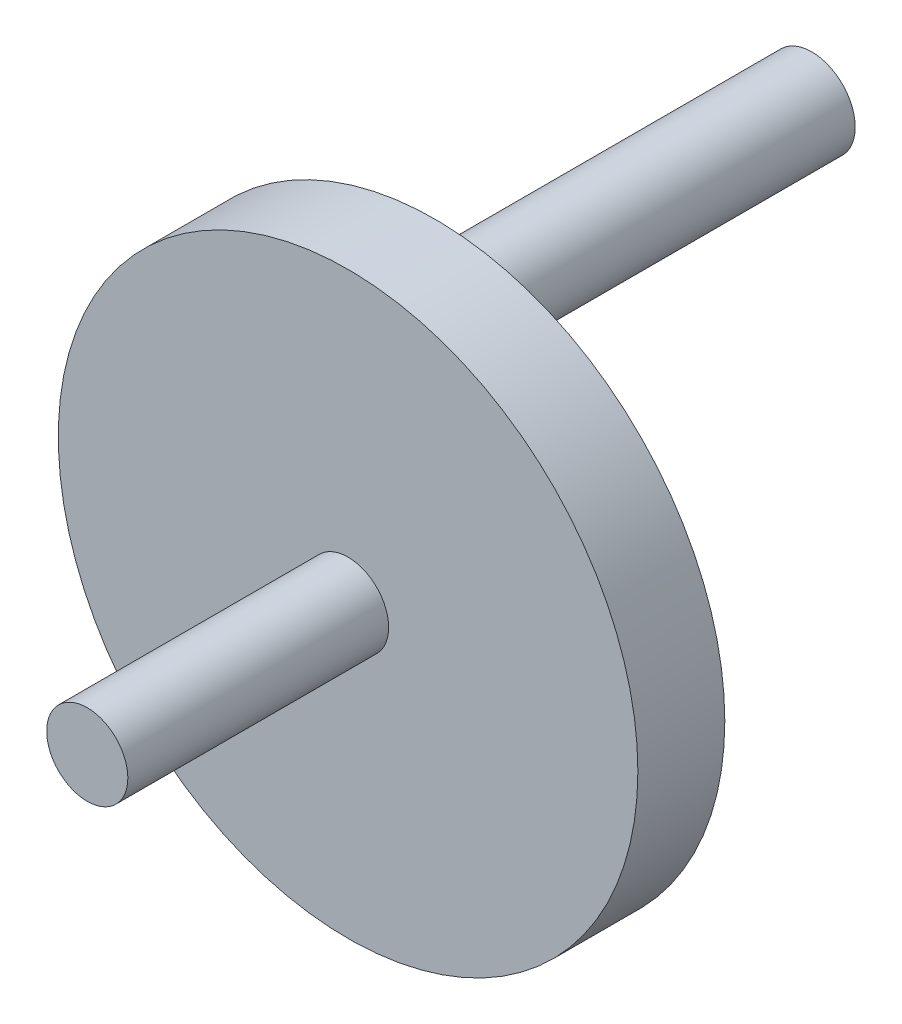
ISO-10303-21;
HEADER;
FILE_DESCRIPTION(('STEP AP214'),'2;1');
FILE_NAME('part.step','',(''),(''),'','','');
FILE_SCHEMA(('AUTOMOTIVE_DESIGN { 1 0 10303 214 1 1 1 1 }'));
ENDSEC;
DATA;
#1=APPLICATION_CONTEXT('core data for automotive mechanical design processes');
#2=APPLICATION_PROTOCOL_DEFINITION('international standard','automotive_design',2000,#1);
#3=PRODUCT_CONTEXT('',#1,'mechanical');
#4=PRODUCT('Part','Part','',(#3));
#5=PRODUCT_RELATED_PRODUCT_CATEGORY('part','',(#4));
#6=PRODUCT_DEFINITION_FORMATION('','',#4);
#7=PRODUCT_DEFINITION_CONTEXT('part definition',#1,'design');
#8=PRODUCT_DEFINITION('design','',#6,#7);
#9=PRODUCT_DEFINITION_SHAPE('','',#8);
#10=(LENGTH_UNIT() NAMED_UNIT(*) SI_UNIT(.MILLI.,.METRE.));
#11=(NAMED_UNIT(*) PLANE_ANGLE_UNIT() SI_UNIT($,.RADIAN.));
#12=(NAMED_UNIT(*) SI_UNIT($,.STERADIAN.) SOLID_ANGLE_UNIT());
#13=UNCERTAINTY_MEASURE_WITH_UNIT(LENGTH_MEASURE(1.E-05),#10,'distance_accuracy_value','');
#14=(GEOMETRIC_REPRESENTATION_CONTEXT(3) GLOBAL_UNCERTAINTY_ASSIGNED_CONTEXT((#13)) GLOBAL_UNIT_ASSIGNED_CONTEXT((#10,
#11,#12)) REPRESENTATION_CONTEXT('',''));
#15=CARTESIAN_POINT('',(0.,0.,0.));
#16=DIRECTION('',(0.,0.,1.));
#17=DIRECTION('',(1.,0.,0.));
#18=AXIS2_PLACEMENT_3D('',#15,#16,#17);
#19=CARTESIAN_POINT('',(0.,0.,15.));
#20=DIRECTION('',(0.,0.,1.));
#21=DIRECTION('',(1.,0.,0.));
#22=AXIS2_PLACEMENT_3D('',#19,#20,#21);
#23=PLANE('',#22);
#24=CARTESIAN_POINT('',(0.,0.,15.));
#25=DIRECTION('',(0.,0.,1.));
#26=DIRECTION('',(1.,0.,0.));
#27=AXIS2_PLACEMENT_3D('',#24,#25,#26);
#28=CIRCLE('',#27,7.);
#29=CARTESIAN_POINT('',(7.,0.,15.));
#30=VERTEX_POINT('',#29);
#31=EDGE_CURVE('E60',#30,#30,#28,.T.);
#32=ORIENTED_EDGE('',*,*,#31,.F.);
#33=EDGE_LOOP('',(#32));
#34=FACE_BOUND('',#33,.T.);
#35=CARTESIAN_POINT('',(0.,0.,15.));
#36=DIRECTION('',(0.,0.,1.));
#37=DIRECTION('',(1.,0.,0.));
#38=AXIS2_PLACEMENT_3D('',#35,#36,#37);
#39=CIRCLE('',#38,50.);
#40=CARTESIAN_POINT('',(50.,0.,15.));
#41=VERTEX_POINT('',#40);
#42=EDGE_CURVE('E10',#41,#41,#39,.T.);
#43=ORIENTED_EDGE('',*,*,#42,.T.);
#44=EDGE_LOOP('',(#43));
#45=FACE_BOUND('',#44,.T.);
#46=ADVANCED_FACE('F37',(#34,#45),#23,.T.);
#47=CARTESIAN_POINT('',(0.,0.,0.));
#48=DIRECTION('',(0.,0.,1.));
#49=DIRECTION('',(1.,0.,0.));
#50=AXIS2_PLACEMENT_3D('',#47,#48,#49);
#51=PLANE('',#50);
#52=CARTESIAN_POINT('',(0.,0.,0.));
#53=DIRECTION('',(0.,0.,1.));
#54=DIRECTION('',(1.,0.,0.));
#55=AXIS2_PLACEMENT_3D('',#52,#53,#54);
#56=CIRCLE('',#55,50.);
#57=CARTESIAN_POINT('',(50.,0.,0.));
#58=VERTEX_POINT('',#57);
#59=EDGE_CURVE('E41',#58,#58,#56,.T.);
#60=ORIENTED_EDGE('',*,*,#59,.F.);
#61=EDGE_LOOP('',(#60));
#62=FACE_BOUND('',#61,.T.);
#63=CARTESIAN_POINT('',(0.,35.,0.));
#64=DIRECTION('',(0.,0.,1.));
#65=DIRECTION('',(1.,0.,0.));
#66=AXIS2_PLACEMENT_3D('',#63,#64,#65);
#67=CIRCLE('',#66,7.5);
#68=CARTESIAN_POINT('',(7.5,35.,0.));
#69=VERTEX_POINT('',#68);
#70=EDGE_CURVE('E50',#69,#69,#67,.T.);
#71=ORIENTED_EDGE('',*,*,#70,.T.);
#72=EDGE_LOOP('',(#71));
#73=FACE_BOUND('',#72,.T.);
#74=ADVANCED_FACE('F78',(#62,#73),#51,.F.);
#75=CARTESIAN_POINT('',(0.,0.,15.));
#76=DIRECTION('',(0.,0.,-1.));
#77=DIRECTION('',(-1.,0.,0.));
#78=AXIS2_PLACEMENT_3D('',#75,#76,#77);
#79=CYLINDRICAL_SURFACE('',#78,50.);
#80=ORIENTED_EDGE('',*,*,#42,.F.);
#81=EDGE_LOOP('',(#80));
#82=FACE_BOUND('',#81,.T.);
#83=ORIENTED_EDGE('',*,*,#59,.T.);
#84=EDGE_LOOP('',(#83));
#85=FACE_BOUND('',#84,.T.);
#86=ADVANCED_FACE('F39',(#82,#85),#79,.T.);
#87=CARTESIAN_POINT('',(0.,35.,-65.));
#88=DIRECTION('',(0.,0.,1.));
#89=DIRECTION('',(1.,0.,0.));
#90=AXIS2_PLACEMENT_3D('',#87,#88,#89);
#91=CYLINDRICAL_SURFACE('',#90,7.5);
#92=CARTESIAN_POINT('',(0.,35.,-65.));
#93=DIRECTION('',(0.,0.,1.));
#94=DIRECTION('',(1.,0.,0.));
#95=AXIS2_PLACEMENT_3D('',#92,#93,#94);
#96=CIRCLE('',#95,7.5);
#97=CARTESIAN_POINT('',(7.5,35.,-65.));
#98=VERTEX_POINT('',#97);
#99=EDGE_CURVE('E55',#98,#98,#96,.T.);
#100=ORIENTED_EDGE('',*,*,#99,.T.);
#101=EDGE_LOOP('',(#100));
#102=FACE_BOUND('',#101,.T.);
#103=ORIENTED_EDGE('',*,*,#70,.F.);
#104=EDGE_LOOP('',(#103));
#105=FACE_BOUND('',#104,.T.);
#106=ADVANCED_FACE('F85',(#102,#105),#91,.T.);
#107=CARTESIAN_POINT('',(0.,35.,-65.));
#108=DIRECTION('',(0.,0.,1.));
#109=DIRECTION('',(1.,0.,0.));
#110=AXIS2_PLACEMENT_3D('',#107,#108,#109);
#111=PLANE('',#110);
#112=ORIENTED_EDGE('',*,*,#99,.F.);
#113=EDGE_LOOP('',(#112));
#114=FACE_BOUND('',#113,.T.);
#115=ADVANCED_FACE('F73',(#114),#111,.F.);
#116=CARTESIAN_POINT('',(0.,0.,60.));
#117=DIRECTION('',(0.,0.,-1.));
#118=DIRECTION('',(-1.,0.,0.));
#119=AXIS2_PLACEMENT_3D('',#116,#117,#118);
#120=CYLINDRICAL_SURFACE('',#119,7.);
#121=CARTESIAN_POINT('',(0.,0.,60.));
#122=DIRECTION('',(0.,0.,1.));
#123=DIRECTION('',(1.,0.,0.));
#124=AXIS2_PLACEMENT_3D('',#121,#122,#123);
#125=CIRCLE('',#124,7.);
#126=CARTESIAN_POINT('',(7.,0.,60.));
#127=VERTEX_POINT('',#126);
#128=EDGE_CURVE('E59',#127,#127,#125,.T.);
#129=ORIENTED_EDGE('',*,*,#128,.F.);
#130=EDGE_LOOP('',(#129));
#131=FACE_BOUND('',#130,.T.);
#132=ORIENTED_EDGE('',*,*,#31,.T.);
#133=EDGE_LOOP('',(#132));
#134=FACE_BOUND('',#133,.T.);
#135=ADVANCED_FACE('F70',(#131,#134),#120,.T.);
#136=CARTESIAN_POINT('',(0.,0.,60.));
#137=DIRECTION('',(0.,0.,1.));
#138=DIRECTION('',(1.,0.,0.));
#139=AXIS2_PLACEMENT_3D('',#136,#137,#138);
#140=PLANE('',#139);
#141=ORIENTED_EDGE('',*,*,#128,.T.);
#142=EDGE_LOOP('',(#141));
#143=FACE_BOUND('',#142,.T.);
#144=ADVANCED_FACE('F68',(#143),#140,.T.);
#145=CLOSED_SHELL('',(#46,#74,#86,#106,#115,#135,#144));
#146=MANIFOLD_SOLID_BREP('B2',#145);
#147=ADVANCED_BREP_SHAPE_REPRESENTATION('',(#18,#146),#14);
#148=SHAPE_DEFINITION_REPRESENTATION(#9,#147);
ENDSEC;
END-ISO-10303-21;
